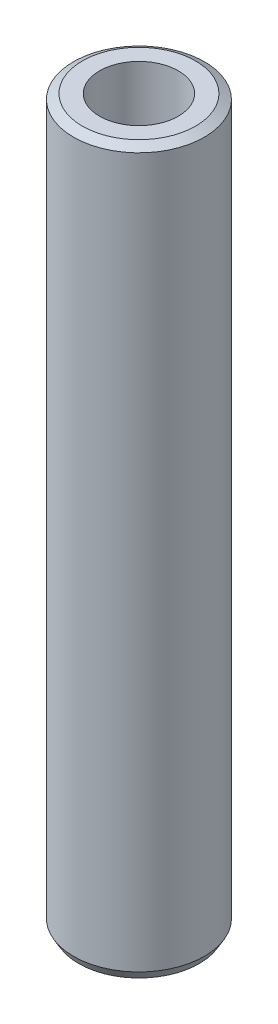
ISO-10303-21;
HEADER;
FILE_DESCRIPTION(('STEP AP214'),'2;1');
FILE_NAME('part.step','',(''),(''),'','','');
FILE_SCHEMA(('AUTOMOTIVE_DESIGN { 1 0 10303 214 1 1 1 1 }'));
ENDSEC;
DATA;
#1=APPLICATION_CONTEXT('core data for automotive mechanical design processes');
#2=APPLICATION_PROTOCOL_DEFINITION('international standard','automotive_design',2000,#1);
#3=PRODUCT_CONTEXT('',#1,'mechanical');
#4=PRODUCT('Part','Part','',(#3));
#5=PRODUCT_RELATED_PRODUCT_CATEGORY('part','',(#4));
#6=PRODUCT_DEFINITION_FORMATION('','',#4);
#7=PRODUCT_DEFINITION_CONTEXT('part definition',#1,'design');
#8=PRODUCT_DEFINITION('design','',#6,#7);
#9=PRODUCT_DEFINITION_SHAPE('','',#8);
#10=(LENGTH_UNIT() NAMED_UNIT(*) SI_UNIT(.MILLI.,.METRE.));
#11=(NAMED_UNIT(*) PLANE_ANGLE_UNIT() SI_UNIT($,.RADIAN.));
#12=(NAMED_UNIT(*) SI_UNIT($,.STERADIAN.) SOLID_ANGLE_UNIT());
#13=UNCERTAINTY_MEASURE_WITH_UNIT(LENGTH_MEASURE(1.E-05),#10,'distance_accuracy_value','');
#14=(GEOMETRIC_REPRESENTATION_CONTEXT(3) GLOBAL_UNCERTAINTY_ASSIGNED_CONTEXT((#13)) GLOBAL_UNIT_ASSIGNED_CONTEXT((#10,
#11,#12)) REPRESENTATION_CONTEXT('',''));
#15=CARTESIAN_POINT('',(0.,0.,0.));
#16=DIRECTION('',(0.,0.,1.));
#17=DIRECTION('',(1.,0.,0.));
#18=AXIS2_PLACEMENT_3D('',#15,#16,#17);
#19=CARTESIAN_POINT('',(0.,331.6265461221,0.));
#20=DIRECTION('',(0.,-1.,0.));
#21=DIRECTION('',(0.,0.,-1.));
#22=AXIS2_PLACEMENT_3D('',#19,#20,#21);
#23=CYLINDRICAL_SURFACE('',#22,30.);
#24=CARTESIAN_POINT('',(0.,329.282447690706,0.));
#25=DIRECTION('',(0.,1.,0.));
#26=DIRECTION('',(0.,0.,1.));
#27=AXIS2_PLACEMENT_3D('',#24,#25,#26);
#28=CIRCLE('',#27,30.);
#29=CARTESIAN_POINT('',(0.,329.282447690706,30.));
#30=VERTEX_POINT('',#29);
#31=EDGE_CURVE('E50',#30,#30,#28,.F.);
#32=ORIENTED_EDGE('',*,*,#31,.T.);
#33=EDGE_LOOP('',(#32));
#34=FACE_BOUND('',#33,.T.);
#35=CARTESIAN_POINT('',(0.,4.06009758111708,0.));
#36=DIRECTION('',(0.,1.,0.));
#37=DIRECTION('',(0.,0.,1.));
#38=AXIS2_PLACEMENT_3D('',#35,#36,#37);
#39=CIRCLE('',#38,30.);
#40=CARTESIAN_POINT('',(0.,4.06009758111708,30.));
#41=VERTEX_POINT('',#40);
#42=EDGE_CURVE('E51',#41,#41,#39,.T.);
#43=ORIENTED_EDGE('',*,*,#42,.T.);
#44=EDGE_LOOP('',(#43));
#45=FACE_BOUND('',#44,.T.);
#46=ADVANCED_FACE('F39',(#34,#45),#23,.T.);
#47=CARTESIAN_POINT('',(0.,331.6265461221,0.));
#48=DIRECTION('',(0.,1.,0.));
#49=DIRECTION('',(0.,0.,1.));
#50=AXIS2_PLACEMENT_3D('',#47,#48,#49);
#51=PLANE('',#50);
#52=CARTESIAN_POINT('',(0.,331.6265461221,0.));
#53=DIRECTION('',(0.,1.,0.));
#54=DIRECTION('',(0.,0.,1.));
#55=AXIS2_PLACEMENT_3D('',#52,#53,#54);
#56=CIRCLE('',#55,25.9399024188829);
#57=CARTESIAN_POINT('',(0.,331.6265461221,25.9399024188829));
#58=VERTEX_POINT('',#57);
#59=EDGE_CURVE('E54',#58,#58,#56,.T.);
#60=ORIENTED_EDGE('',*,*,#59,.T.);
#61=EDGE_LOOP('',(#60));
#62=FACE_BOUND('',#61,.T.);
#63=CARTESIAN_POINT('',(0.,331.6265461221,0.));
#64=DIRECTION('',(0.,1.,0.));
#65=DIRECTION('',(0.,0.,1.));
#66=AXIS2_PLACEMENT_3D('',#63,#64,#65);
#67=CIRCLE('',#66,18.0520228723046);
#68=CARTESIAN_POINT('',(0.,331.6265461221,18.0520228723046));
#69=VERTEX_POINT('',#68);
#70=EDGE_CURVE('E58',#69,#69,#67,.T.);
#71=ORIENTED_EDGE('',*,*,#70,.F.);
#72=EDGE_LOOP('',(#71));
#73=FACE_BOUND('',#72,.T.);
#74=ADVANCED_FACE('F69',(#62,#73),#51,.T.);
#75=CARTESIAN_POINT('',(0.,0.,0.));
#76=DIRECTION('',(0.,1.,0.));
#77=DIRECTION('',(0.,0.,1.));
#78=AXIS2_PLACEMENT_3D('',#75,#76,#77);
#79=PLANE('',#78);
#80=CARTESIAN_POINT('',(0.,0.,0.));
#81=DIRECTION('',(0.,1.,0.));
#82=DIRECTION('',(0.,0.,1.));
#83=AXIS2_PLACEMENT_3D('',#80,#81,#82);
#84=CIRCLE('',#83,27.6559015686059);
#85=CARTESIAN_POINT('',(0.,0.,27.6559015686059));
#86=VERTEX_POINT('',#85);
#87=EDGE_CURVE('E10',#86,#86,#84,.F.);
#88=ORIENTED_EDGE('',*,*,#87,.T.);
#89=EDGE_LOOP('',(#88));
#90=FACE_BOUND('',#89,.T.);
#91=CARTESIAN_POINT('',(0.,0.,0.));
#92=DIRECTION('',(0.,1.,0.));
#93=DIRECTION('',(0.,0.,1.));
#94=AXIS2_PLACEMENT_3D('',#91,#92,#93);
#95=CIRCLE('',#94,18.0520228723046);
#96=CARTESIAN_POINT('',(0.,0.,18.0520228723046));
#97=VERTEX_POINT('',#96);
#98=EDGE_CURVE('E63',#97,#97,#95,.T.);
#99=ORIENTED_EDGE('',*,*,#98,.T.);
#100=EDGE_LOOP('',(#99));
#101=FACE_BOUND('',#100,.T.);
#102=ADVANCED_FACE('F75',(#90,#101),#79,.F.);
#103=CARTESIAN_POINT('',(0.,331.6265461221,0.));
#104=DIRECTION('',(0.,-1.,0.));
#105=DIRECTION('',(0.,0.,-1.));
#106=AXIS2_PLACEMENT_3D('',#103,#104,#105);
#107=CYLINDRICAL_SURFACE('',#106,18.0520228723046);
#108=ORIENTED_EDGE('',*,*,#70,.T.);
#109=EDGE_LOOP('',(#108));
#110=FACE_BOUND('',#109,.T.);
#111=ORIENTED_EDGE('',*,*,#98,.F.);
#112=EDGE_LOOP('',(#111));
#113=FACE_BOUND('',#112,.T.);
#114=ADVANCED_FACE('F70',(#110,#113),#107,.F.);
#115=CARTESIAN_POINT('',(0.,331.6265461221,0.));
#116=DIRECTION('',(0.,-1.,0.));
#117=DIRECTION('',(0.,0.,-1.));
#118=AXIS2_PLACEMENT_3D('',#115,#116,#117);
#119=CONICAL_SURFACE('',#118,25.9399024188829,1.0471975511966);
#120=ORIENTED_EDGE('',*,*,#31,.F.);
#121=EDGE_LOOP('',(#120));
#122=FACE_BOUND('',#121,.T.);
#123=ORIENTED_EDGE('',*,*,#59,.F.);
#124=EDGE_LOOP('',(#123));
#125=FACE_BOUND('',#124,.T.);
#126=ADVANCED_FACE('F81',(#122,#125),#119,.T.);
#127=CARTESIAN_POINT('',(0.,4.06009758111708,0.));
#128=DIRECTION('',(0.,1.,0.));
#129=DIRECTION('',(0.,0.,1.));
#130=AXIS2_PLACEMENT_3D('',#127,#128,#129);
#131=CONICAL_SURFACE('',#130,30.,0.523598775598305);
#132=ORIENTED_EDGE('',*,*,#87,.F.);
#133=EDGE_LOOP('',(#132));
#134=FACE_BOUND('',#133,.T.);
#135=ORIENTED_EDGE('',*,*,#42,.F.);
#136=EDGE_LOOP('',(#135));
#137=FACE_BOUND('',#136,.T.);
#138=ADVANCED_FACE('F45',(#134,#137),#131,.T.);
#139=CLOSED_SHELL('',(#46,#74,#102,#114,#126,#138));
#140=MANIFOLD_SOLID_BREP('B2',#139);
#141=ADVANCED_BREP_SHAPE_REPRESENTATION('',(#18,#140),#14);
#142=SHAPE_DEFINITION_REPRESENTATION(#9,#141);
ENDSEC;
END-ISO-10303-21;
